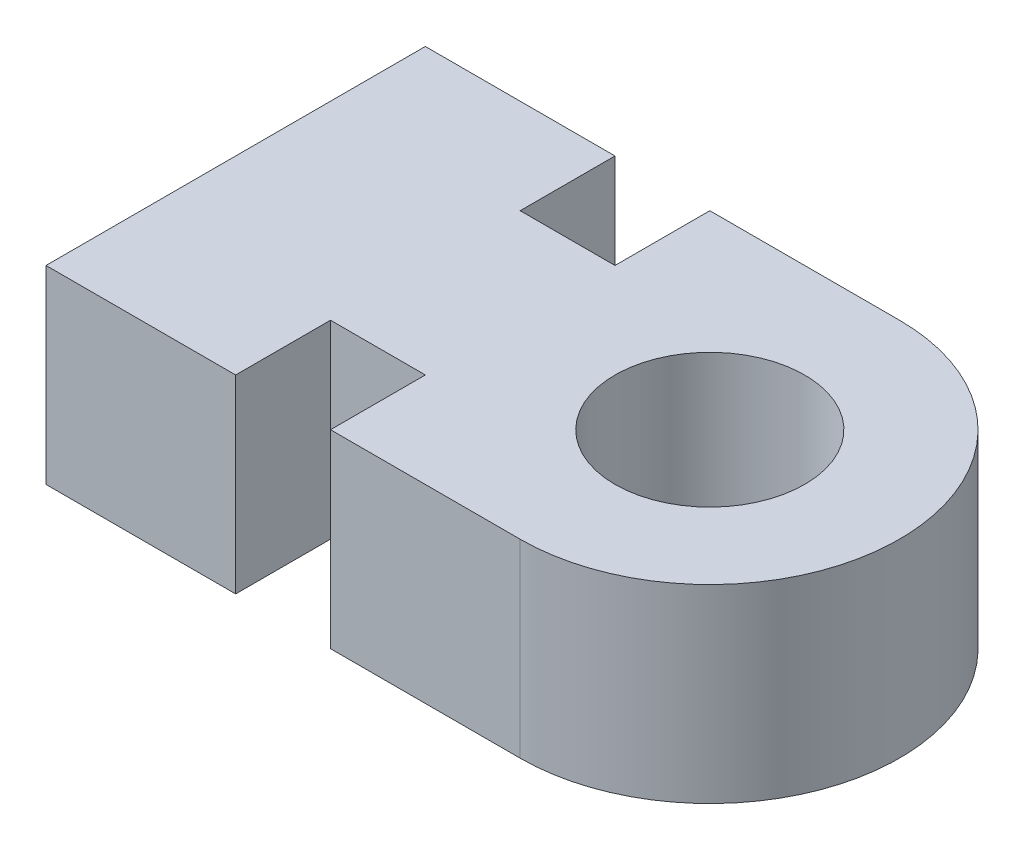
ISO-10303-21;
HEADER;
FILE_DESCRIPTION(('STEP AP214'),'2;1');
FILE_NAME('part.step','',(''),(''),'','','');
FILE_SCHEMA(('AUTOMOTIVE_DESIGN { 1 0 10303 214 1 1 1 1 }'));
ENDSEC;
DATA;
#1=APPLICATION_CONTEXT('core data for automotive mechanical design processes');
#2=APPLICATION_PROTOCOL_DEFINITION('international standard','automotive_design',2000,#1);
#3=PRODUCT_CONTEXT('',#1,'mechanical');
#4=PRODUCT('Part','Part','',(#3));
#5=PRODUCT_RELATED_PRODUCT_CATEGORY('part','',(#4));
#6=PRODUCT_DEFINITION_FORMATION('','',#4);
#7=PRODUCT_DEFINITION_CONTEXT('part definition',#1,'design');
#8=PRODUCT_DEFINITION('design','',#6,#7);
#9=PRODUCT_DEFINITION_SHAPE('','',#8);
#10=(LENGTH_UNIT() NAMED_UNIT(*) SI_UNIT(.MILLI.,.METRE.));
#11=(NAMED_UNIT(*) PLANE_ANGLE_UNIT() SI_UNIT($,.RADIAN.));
#12=(NAMED_UNIT(*) SI_UNIT($,.STERADIAN.) SOLID_ANGLE_UNIT());
#13=UNCERTAINTY_MEASURE_WITH_UNIT(LENGTH_MEASURE(1.E-05),#10,'distance_accuracy_value','');
#14=(GEOMETRIC_REPRESENTATION_CONTEXT(3) GLOBAL_UNCERTAINTY_ASSIGNED_CONTEXT((#13)) GLOBAL_UNIT_ASSIGNED_CONTEXT((#10,
#11,#12)) REPRESENTATION_CONTEXT('',''));
#15=CARTESIAN_POINT('',(0.,0.,0.));
#16=DIRECTION('',(0.,0.,1.));
#17=DIRECTION('',(1.,0.,0.));
#18=AXIS2_PLACEMENT_3D('',#15,#16,#17);
#19=CARTESIAN_POINT('',(-7.50495335268535,6.,2.));
#20=DIRECTION('',(0.,0.,1.));
#21=DIRECTION('',(1.,0.,0.));
#22=AXIS2_PLACEMENT_3D('',#19,#20,#21);
#23=PLANE('',#22);
#24=DIRECTION('',(-1.,0.,0.));
#25=VECTOR('',#24,1.);
#26=CARTESIAN_POINT('',(-7.50495335268535,4.,2.));
#27=LINE('',#26,#25);
#28=CARTESIAN_POINT('',(-7.50495335268535,4.,2.));
#29=VERTEX_POINT('',#28);
#30=CARTESIAN_POINT('',(-9.50495335268535,4.,2.));
#31=VERTEX_POINT('',#30);
#32=EDGE_CURVE('E186',#29,#31,#27,.T.);
#33=ORIENTED_EDGE('',*,*,#32,.F.);
#34=DIRECTION('',(0.,-1.,0.));
#35=VECTOR('',#34,1.);
#36=CARTESIAN_POINT('',(-7.50495335268535,6.,2.));
#37=LINE('',#36,#35);
#38=CARTESIAN_POINT('',(-7.50495335268535,6.,2.));
#39=VERTEX_POINT('',#38);
#40=EDGE_CURVE('E11',#39,#29,#37,.T.);
#41=ORIENTED_EDGE('',*,*,#40,.F.);
#42=DIRECTION('',(-1.,0.,0.));
#43=VECTOR('',#42,1.);
#44=CARTESIAN_POINT('',(-7.50495335268535,6.,2.));
#45=LINE('',#44,#43);
#46=CARTESIAN_POINT('',(-9.50495335268535,6.,2.));
#47=VERTEX_POINT('',#46);
#48=EDGE_CURVE('E276',#39,#47,#45,.T.);
#49=ORIENTED_EDGE('',*,*,#48,.T.);
#50=DIRECTION('',(0.,-1.,0.));
#51=VECTOR('',#50,1.);
#52=CARTESIAN_POINT('',(-9.50495335268535,6.,2.));
#53=LINE('',#52,#51);
#54=EDGE_CURVE('E55',#47,#31,#53,.T.);
#55=ORIENTED_EDGE('',*,*,#54,.T.);
#56=EDGE_LOOP('',(#33,#41,#49,#55));
#57=FACE_BOUND('',#56,.T.);
#58=ADVANCED_FACE('F38',(#57),#23,.T.);
#59=CARTESIAN_POINT('',(-7.50495335268535,6.,0.));
#60=DIRECTION('',(0.,-1.,0.));
#61=DIRECTION('',(0.,0.,-1.));
#62=AXIS2_PLACEMENT_3D('',#59,#60,#61);
#63=CYLINDRICAL_SURFACE('',#62,2.);
#64=CARTESIAN_POINT('',(-7.50495335268535,4.,0.));
#65=DIRECTION('',(0.,1.,0.));
#66=DIRECTION('',(0.,0.,1.));
#67=AXIS2_PLACEMENT_3D('',#64,#65,#66);
#68=CIRCLE('',#67,2.);
#69=CARTESIAN_POINT('',(-7.50495335268535,4.,-2.));
#70=VERTEX_POINT('',#69);
#71=EDGE_CURVE('E183',#29,#70,#68,.T.);
#72=ORIENTED_EDGE('',*,*,#71,.T.);
#73=DIRECTION('',(0.,-1.,0.));
#74=VECTOR('',#73,1.);
#75=CARTESIAN_POINT('',(-7.50495335268535,6.,-2.));
#76=LINE('',#75,#74);
#77=CARTESIAN_POINT('',(-7.50495335268535,6.,-2.));
#78=VERTEX_POINT('',#77);
#79=EDGE_CURVE('E47',#78,#70,#76,.T.);
#80=ORIENTED_EDGE('',*,*,#79,.F.);
#81=CARTESIAN_POINT('',(-7.50495335268535,6.,0.));
#82=DIRECTION('',(0.,1.,0.));
#83=DIRECTION('',(0.,0.,1.));
#84=AXIS2_PLACEMENT_3D('',#81,#82,#83);
#85=CIRCLE('',#84,2.);
#86=EDGE_CURVE('E274',#39,#78,#85,.T.);
#87=ORIENTED_EDGE('',*,*,#86,.F.);
#88=ORIENTED_EDGE('',*,*,#40,.T.);
#89=EDGE_LOOP('',(#72,#80,#87,#88));
#90=FACE_BOUND('',#89,.T.);
#91=ADVANCED_FACE('F184',(#90),#63,.T.);
#92=CARTESIAN_POINT('',(-7.50495335268535,6.,-2.));
#93=DIRECTION('',(0.,0.,1.));
#94=DIRECTION('',(1.,0.,0.));
#95=AXIS2_PLACEMENT_3D('',#92,#93,#94);
#96=PLANE('',#95);
#97=DIRECTION('',(-1.,0.,0.));
#98=VECTOR('',#97,1.);
#99=CARTESIAN_POINT('',(-7.50495335268535,4.,-2.));
#100=LINE('',#99,#98);
#101=CARTESIAN_POINT('',(-9.50495335268535,4.,-2.));
#102=VERTEX_POINT('',#101);
#103=EDGE_CURVE('E177',#70,#102,#100,.T.);
#104=ORIENTED_EDGE('',*,*,#103,.T.);
#105=DIRECTION('',(0.,-1.,0.));
#106=VECTOR('',#105,1.);
#107=CARTESIAN_POINT('',(-9.50495335268535,6.,-2.));
#108=LINE('',#107,#106);
#109=CARTESIAN_POINT('',(-9.50495335268535,6.,-2.));
#110=VERTEX_POINT('',#109);
#111=EDGE_CURVE('E168',#110,#102,#108,.T.);
#112=ORIENTED_EDGE('',*,*,#111,.F.);
#113=DIRECTION('',(-1.,0.,0.));
#114=VECTOR('',#113,1.);
#115=CARTESIAN_POINT('',(-7.50495335268535,6.,-2.));
#116=LINE('',#115,#114);
#117=EDGE_CURVE('E179',#78,#110,#116,.T.);
#118=ORIENTED_EDGE('',*,*,#117,.F.);
#119=ORIENTED_EDGE('',*,*,#79,.T.);
#120=EDGE_LOOP('',(#104,#112,#118,#119));
#121=FACE_BOUND('',#120,.T.);
#122=ADVANCED_FACE('F175',(#121),#96,.F.);
#123=CARTESIAN_POINT('',(-9.50495335268535,6.,0.));
#124=DIRECTION('',(1.,0.,0.));
#125=DIRECTION('',(0.,0.,-1.));
#126=AXIS2_PLACEMENT_3D('',#123,#124,#125);
#127=PLANE('',#126);
#128=DIRECTION('',(0.,0.,1.));
#129=VECTOR('',#128,1.);
#130=CARTESIAN_POINT('',(-9.50495335268535,4.,0.));
#131=LINE('',#130,#129);
#132=CARTESIAN_POINT('',(-9.50495335268535,4.,-1.));
#133=VERTEX_POINT('',#132);
#134=EDGE_CURVE('E188',#102,#133,#131,.T.);
#135=ORIENTED_EDGE('',*,*,#134,.T.);
#136=DIRECTION('',(0.,-1.,0.));
#137=VECTOR('',#136,1.);
#138=CARTESIAN_POINT('',(-9.50495335268535,6.,-1.));
#139=LINE('',#138,#137);
#140=CARTESIAN_POINT('',(-9.50495335268535,6.,-1.));
#141=VERTEX_POINT('',#140);
#142=EDGE_CURVE('E166',#141,#133,#139,.T.);
#143=ORIENTED_EDGE('',*,*,#142,.F.);
#144=DIRECTION('',(0.,0.,1.));
#145=VECTOR('',#144,1.);
#146=CARTESIAN_POINT('',(-9.50495335268535,6.,0.));
#147=LINE('',#146,#145);
#148=EDGE_CURVE('E272',#110,#141,#147,.T.);
#149=ORIENTED_EDGE('',*,*,#148,.F.);
#150=ORIENTED_EDGE('',*,*,#111,.T.);
#151=EDGE_LOOP('',(#135,#143,#149,#150));
#152=FACE_BOUND('',#151,.T.);
#153=ADVANCED_FACE('F271',(#152),#127,.F.);
#154=CARTESIAN_POINT('',(-7.50495335268535,6.,-1.));
#155=DIRECTION('',(0.,0.,-1.));
#156=DIRECTION('',(-1.,0.,0.));
#157=AXIS2_PLACEMENT_3D('',#154,#155,#156);
#158=PLANE('',#157);
#159=DIRECTION('',(1.,0.,0.));
#160=VECTOR('',#159,1.);
#161=CARTESIAN_POINT('',(-7.50495335268535,4.,-1.));
#162=LINE('',#161,#160);
#163=CARTESIAN_POINT('',(-10.5049533526853,4.,-1.));
#164=VERTEX_POINT('',#163);
#165=EDGE_CURVE('E198',#164,#133,#162,.T.);
#166=ORIENTED_EDGE('',*,*,#165,.F.);
#167=DIRECTION('',(0.,-1.,0.));
#168=VECTOR('',#167,1.);
#169=CARTESIAN_POINT('',(-10.5049533526853,6.,-1.));
#170=LINE('',#169,#168);
#171=CARTESIAN_POINT('',(-10.5049533526853,6.,-1.));
#172=VERTEX_POINT('',#171);
#173=EDGE_CURVE('E164',#172,#164,#170,.T.);
#174=ORIENTED_EDGE('',*,*,#173,.F.);
#175=DIRECTION('',(1.,0.,0.));
#176=VECTOR('',#175,1.);
#177=CARTESIAN_POINT('',(-7.50495335268535,6.,-1.));
#178=LINE('',#177,#176);
#179=EDGE_CURVE('E269',#172,#141,#178,.T.);
#180=ORIENTED_EDGE('',*,*,#179,.T.);
#181=ORIENTED_EDGE('',*,*,#142,.T.);
#182=EDGE_LOOP('',(#166,#174,#180,#181));
#183=FACE_BOUND('',#182,.T.);
#184=ADVANCED_FACE('F265',(#183),#158,.T.);
#185=CARTESIAN_POINT('',(-10.5049533526853,6.,0.));
#186=DIRECTION('',(1.,0.,0.));
#187=DIRECTION('',(0.,0.,-1.));
#188=AXIS2_PLACEMENT_3D('',#185,#186,#187);
#189=PLANE('',#188);
#190=DIRECTION('',(0.,0.,1.));
#191=VECTOR('',#190,1.);
#192=CARTESIAN_POINT('',(-10.5049533526853,4.,0.));
#193=LINE('',#192,#191);
#194=CARTESIAN_POINT('',(-10.5049533526853,4.,-2.));
#195=VERTEX_POINT('',#194);
#196=EDGE_CURVE('E201',#195,#164,#193,.T.);
#197=ORIENTED_EDGE('',*,*,#196,.F.);
#198=DIRECTION('',(0.,-1.,0.));
#199=VECTOR('',#198,1.);
#200=CARTESIAN_POINT('',(-10.5049533526853,6.,-2.));
#201=LINE('',#200,#199);
#202=CARTESIAN_POINT('',(-10.5049533526853,6.,-2.));
#203=VERTEX_POINT('',#202);
#204=EDGE_CURVE('E162',#203,#195,#201,.T.);
#205=ORIENTED_EDGE('',*,*,#204,.F.);
#206=DIRECTION('',(0.,0.,1.));
#207=VECTOR('',#206,1.);
#208=CARTESIAN_POINT('',(-10.5049533526853,6.,0.));
#209=LINE('',#208,#207);
#210=EDGE_CURVE('E262',#203,#172,#209,.T.);
#211=ORIENTED_EDGE('',*,*,#210,.T.);
#212=ORIENTED_EDGE('',*,*,#173,.T.);
#213=EDGE_LOOP('',(#197,#205,#211,#212));
#214=FACE_BOUND('',#213,.T.);
#215=ADVANCED_FACE('F261',(#214),#189,.T.);
#216=CARTESIAN_POINT('',(-12.5049533526853,4.,-2.));
#217=VERTEX_POINT('',#216);
#218=EDGE_CURVE('E190',#195,#217,#100,.T.);
#219=ORIENTED_EDGE('',*,*,#218,.T.);
#220=DIRECTION('',(0.,-1.,0.));
#221=VECTOR('',#220,1.);
#222=CARTESIAN_POINT('',(-12.5049533526853,6.,-2.));
#223=LINE('',#222,#221);
#224=CARTESIAN_POINT('',(-12.5049533526853,6.,-2.));
#225=VERTEX_POINT('',#224);
#226=EDGE_CURVE('E159',#225,#217,#223,.T.);
#227=ORIENTED_EDGE('',*,*,#226,.F.);
#228=EDGE_CURVE('E257',#203,#225,#116,.T.);
#229=ORIENTED_EDGE('',*,*,#228,.F.);
#230=ORIENTED_EDGE('',*,*,#204,.T.);
#231=EDGE_LOOP('',(#219,#227,#229,#230));
#232=FACE_BOUND('',#231,.T.);
#233=ADVANCED_FACE('F244',(#232),#96,.F.);
#234=CARTESIAN_POINT('',(-12.5049533526853,6.,0.));
#235=DIRECTION('',(1.,0.,0.));
#236=DIRECTION('',(0.,0.,-1.));
#237=AXIS2_PLACEMENT_3D('',#234,#235,#236);
#238=PLANE('',#237);
#239=DIRECTION('',(0.,0.,1.));
#240=VECTOR('',#239,1.);
#241=CARTESIAN_POINT('',(-12.5049533526853,4.,0.));
#242=LINE('',#241,#240);
#243=CARTESIAN_POINT('',(-12.5049533526853,4.,2.));
#244=VERTEX_POINT('',#243);
#245=EDGE_CURVE('E204',#217,#244,#242,.T.);
#246=ORIENTED_EDGE('',*,*,#245,.T.);
#247=DIRECTION('',(0.,-1.,0.));
#248=VECTOR('',#247,1.);
#249=CARTESIAN_POINT('',(-12.5049533526853,6.,2.));
#250=LINE('',#249,#248);
#251=CARTESIAN_POINT('',(-12.5049533526853,6.,2.));
#252=VERTEX_POINT('',#251);
#253=EDGE_CURVE('E153',#252,#244,#250,.T.);
#254=ORIENTED_EDGE('',*,*,#253,.F.);
#255=DIRECTION('',(0.,0.,1.));
#256=VECTOR('',#255,1.);
#257=CARTESIAN_POINT('',(-12.5049533526853,6.,0.));
#258=LINE('',#257,#256);
#259=EDGE_CURVE('E253',#225,#252,#258,.T.);
#260=ORIENTED_EDGE('',*,*,#259,.F.);
#261=ORIENTED_EDGE('',*,*,#226,.T.);
#262=EDGE_LOOP('',(#246,#254,#260,#261));
#263=FACE_BOUND('',#262,.T.);
#264=ADVANCED_FACE('F238',(#263),#238,.F.);
#265=CARTESIAN_POINT('',(-10.5049533526853,4.,2.));
#266=VERTEX_POINT('',#265);
#267=EDGE_CURVE('E193',#266,#244,#27,.T.);
#268=ORIENTED_EDGE('',*,*,#267,.F.);
#269=DIRECTION('',(0.,-1.,0.));
#270=VECTOR('',#269,1.);
#271=CARTESIAN_POINT('',(-10.5049533526853,6.,2.));
#272=LINE('',#271,#270);
#273=CARTESIAN_POINT('',(-10.5049533526853,6.,2.));
#274=VERTEX_POINT('',#273);
#275=EDGE_CURVE('E151',#274,#266,#272,.T.);
#276=ORIENTED_EDGE('',*,*,#275,.F.);
#277=EDGE_CURVE('E145',#274,#252,#45,.T.);
#278=ORIENTED_EDGE('',*,*,#277,.T.);
#279=ORIENTED_EDGE('',*,*,#253,.T.);
#280=EDGE_LOOP('',(#268,#276,#278,#279));
#281=FACE_BOUND('',#280,.T.);
#282=ADVANCED_FACE('F231',(#281),#23,.T.);
#283=CARTESIAN_POINT('',(-10.5049533526853,6.,0.));
#284=DIRECTION('',(-1.,0.,0.));
#285=DIRECTION('',(0.,0.,1.));
#286=AXIS2_PLACEMENT_3D('',#283,#284,#285);
#287=PLANE('',#286);
#288=DIRECTION('',(0.,0.,-1.));
#289=VECTOR('',#288,1.);
#290=CARTESIAN_POINT('',(-10.5049533526853,4.,0.));
#291=LINE('',#290,#289);
#292=CARTESIAN_POINT('',(-10.5049533526853,4.,1.));
#293=VERTEX_POINT('',#292);
#294=EDGE_CURVE('E150',#266,#293,#291,.T.);
#295=ORIENTED_EDGE('',*,*,#294,.T.);
#296=DIRECTION('',(0.,-1.,0.));
#297=VECTOR('',#296,1.);
#298=CARTESIAN_POINT('',(-10.5049533526853,6.,1.));
#299=LINE('',#298,#297);
#300=CARTESIAN_POINT('',(-10.5049533526853,6.,1.));
#301=VERTEX_POINT('',#300);
#302=EDGE_CURVE('E133',#301,#293,#299,.T.);
#303=ORIENTED_EDGE('',*,*,#302,.F.);
#304=DIRECTION('',(0.,0.,-1.));
#305=VECTOR('',#304,1.);
#306=CARTESIAN_POINT('',(-10.5049533526853,6.,0.));
#307=LINE('',#306,#305);
#308=EDGE_CURVE('E138',#274,#301,#307,.T.);
#309=ORIENTED_EDGE('',*,*,#308,.F.);
#310=ORIENTED_EDGE('',*,*,#275,.T.);
#311=EDGE_LOOP('',(#295,#303,#309,#310));
#312=FACE_BOUND('',#311,.T.);
#313=ADVANCED_FACE('F148',(#312),#287,.F.);
#314=CARTESIAN_POINT('',(-7.50495335268535,6.,1.));
#315=DIRECTION('',(0.,0.,-1.));
#316=DIRECTION('',(-1.,0.,0.));
#317=AXIS2_PLACEMENT_3D('',#314,#315,#316);
#318=PLANE('',#317);
#319=DIRECTION('',(1.,0.,0.));
#320=VECTOR('',#319,1.);
#321=CARTESIAN_POINT('',(-7.50495335268535,4.,1.));
#322=LINE('',#321,#320);
#323=CARTESIAN_POINT('',(-9.50495335268535,4.,1.));
#324=VERTEX_POINT('',#323);
#325=EDGE_CURVE('E208',#293,#324,#322,.T.);
#326=ORIENTED_EDGE('',*,*,#325,.T.);
#327=DIRECTION('',(0.,-1.,0.));
#328=VECTOR('',#327,1.);
#329=CARTESIAN_POINT('',(-9.50495335268535,6.,1.));
#330=LINE('',#329,#328);
#331=CARTESIAN_POINT('',(-9.50495335268535,6.,1.));
#332=VERTEX_POINT('',#331);
#333=EDGE_CURVE('E93',#332,#324,#330,.T.);
#334=ORIENTED_EDGE('',*,*,#333,.F.);
#335=DIRECTION('',(1.,0.,0.));
#336=VECTOR('',#335,1.);
#337=CARTESIAN_POINT('',(-7.50495335268535,6.,1.));
#338=LINE('',#337,#336);
#339=EDGE_CURVE('E129',#301,#332,#338,.T.);
#340=ORIENTED_EDGE('',*,*,#339,.F.);
#341=ORIENTED_EDGE('',*,*,#302,.T.);
#342=EDGE_LOOP('',(#326,#334,#340,#341));
#343=FACE_BOUND('',#342,.T.);
#344=ADVANCED_FACE('F131',(#343),#318,.F.);
#345=CARTESIAN_POINT('',(-7.50495335268535,6.,0.));
#346=DIRECTION('',(0.,-1.,0.));
#347=DIRECTION('',(0.,0.,-1.));
#348=AXIS2_PLACEMENT_3D('',#345,#346,#347);
#349=CYLINDRICAL_SURFACE('',#348,1.);
#350=CARTESIAN_POINT('',(-7.50495335268535,6.,0.));
#351=DIRECTION('',(0.,1.,0.));
#352=DIRECTION('',(0.,0.,1.));
#353=AXIS2_PLACEMENT_3D('',#350,#351,#352);
#354=CIRCLE('',#353,1.);
#355=CARTESIAN_POINT('',(-7.50495335268535,6.,1.));
#356=VERTEX_POINT('',#355);
#357=EDGE_CURVE('E212',#356,#356,#354,.T.);
#358=ORIENTED_EDGE('',*,*,#357,.T.);
#359=EDGE_LOOP('',(#358));
#360=FACE_BOUND('',#359,.T.);
#361=CARTESIAN_POINT('',(-7.50495335268535,4.,0.));
#362=DIRECTION('',(0.,1.,0.));
#363=DIRECTION('',(0.,0.,1.));
#364=AXIS2_PLACEMENT_3D('',#361,#362,#363);
#365=CIRCLE('',#364,1.);
#366=CARTESIAN_POINT('',(-7.50495335268535,4.,1.));
#367=VERTEX_POINT('',#366);
#368=EDGE_CURVE('E191',#367,#367,#365,.T.);
#369=ORIENTED_EDGE('',*,*,#368,.F.);
#370=EDGE_LOOP('',(#369));
#371=FACE_BOUND('',#370,.T.);
#372=ADVANCED_FACE('F40',(#360,#371),#349,.F.);
#373=CARTESIAN_POINT('',(-9.50495335268535,6.,0.));
#374=DIRECTION('',(-1.,0.,0.));
#375=DIRECTION('',(0.,0.,1.));
#376=AXIS2_PLACEMENT_3D('',#373,#374,#375);
#377=PLANE('',#376);
#378=DIRECTION('',(0.,0.,-1.));
#379=VECTOR('',#378,1.);
#380=CARTESIAN_POINT('',(-9.50495335268535,4.,0.));
#381=LINE('',#380,#379);
#382=EDGE_CURVE('E210',#31,#324,#381,.T.);
#383=ORIENTED_EDGE('',*,*,#382,.F.);
#384=ORIENTED_EDGE('',*,*,#54,.F.);
#385=DIRECTION('',(0.,0.,-1.));
#386=VECTOR('',#385,1.);
#387=CARTESIAN_POINT('',(-9.50495335268535,6.,0.));
#388=LINE('',#387,#386);
#389=EDGE_CURVE('E137',#47,#332,#388,.T.);
#390=ORIENTED_EDGE('',*,*,#389,.T.);
#391=ORIENTED_EDGE('',*,*,#333,.T.);
#392=EDGE_LOOP('',(#383,#384,#390,#391));
#393=FACE_BOUND('',#392,.T.);
#394=ADVANCED_FACE('F220',(#393),#377,.T.);
#395=CARTESIAN_POINT('',(-7.50495335268535,6.,0.));
#396=DIRECTION('',(0.,1.,0.));
#397=DIRECTION('',(0.,0.,1.));
#398=AXIS2_PLACEMENT_3D('',#395,#396,#397);
#399=PLANE('',#398);
#400=ORIENTED_EDGE('',*,*,#357,.F.);
#401=EDGE_LOOP('',(#400));
#402=FACE_BOUND('',#401,.T.);
#403=ORIENTED_EDGE('',*,*,#48,.F.);
#404=ORIENTED_EDGE('',*,*,#86,.T.);
#405=ORIENTED_EDGE('',*,*,#117,.T.);
#406=ORIENTED_EDGE('',*,*,#148,.T.);
#407=ORIENTED_EDGE('',*,*,#179,.F.);
#408=ORIENTED_EDGE('',*,*,#210,.F.);
#409=ORIENTED_EDGE('',*,*,#228,.T.);
#410=ORIENTED_EDGE('',*,*,#259,.T.);
#411=ORIENTED_EDGE('',*,*,#277,.F.);
#412=ORIENTED_EDGE('',*,*,#308,.T.);
#413=ORIENTED_EDGE('',*,*,#339,.T.);
#414=ORIENTED_EDGE('',*,*,#389,.F.);
#415=EDGE_LOOP('',(#403,#404,#405,#406,#407,#408,#409,#410,#411,#412,#413,#414));
#416=FACE_BOUND('',#415,.T.);
#417=ADVANCED_FACE('F143',(#402,#416),#399,.T.);
#418=CARTESIAN_POINT('',(-7.50495335268535,4.,0.));
#419=DIRECTION('',(0.,1.,0.));
#420=DIRECTION('',(0.,0.,1.));
#421=AXIS2_PLACEMENT_3D('',#418,#419,#420);
#422=PLANE('',#421);
#423=ORIENTED_EDGE('',*,*,#368,.T.);
#424=EDGE_LOOP('',(#423));
#425=FACE_BOUND('',#424,.T.);
#426=ORIENTED_EDGE('',*,*,#32,.T.);
#427=ORIENTED_EDGE('',*,*,#382,.T.);
#428=ORIENTED_EDGE('',*,*,#325,.F.);
#429=ORIENTED_EDGE('',*,*,#294,.F.);
#430=ORIENTED_EDGE('',*,*,#267,.T.);
#431=ORIENTED_EDGE('',*,*,#245,.F.);
#432=ORIENTED_EDGE('',*,*,#218,.F.);
#433=ORIENTED_EDGE('',*,*,#196,.T.);
#434=ORIENTED_EDGE('',*,*,#165,.T.);
#435=ORIENTED_EDGE('',*,*,#134,.F.);
#436=ORIENTED_EDGE('',*,*,#103,.F.);
#437=ORIENTED_EDGE('',*,*,#71,.F.);
#438=EDGE_LOOP('',(#426,#427,#428,#429,#430,#431,#432,#433,#434,#435,#436,#437));
#439=FACE_BOUND('',#438,.T.);
#440=ADVANCED_FACE('F217',(#425,#439),#422,.F.);
#441=CLOSED_SHELL('',(#58,#91,#122,#153,#184,#215,#233,#264,#282,#313,#344,#372,#394,#417,#440));
#442=MANIFOLD_SOLID_BREP('B2',#441);
#443=ADVANCED_BREP_SHAPE_REPRESENTATION('',(#18,#442),#14);
#444=SHAPE_DEFINITION_REPRESENTATION(#9,#443);
ENDSEC;
END-ISO-10303-21;
